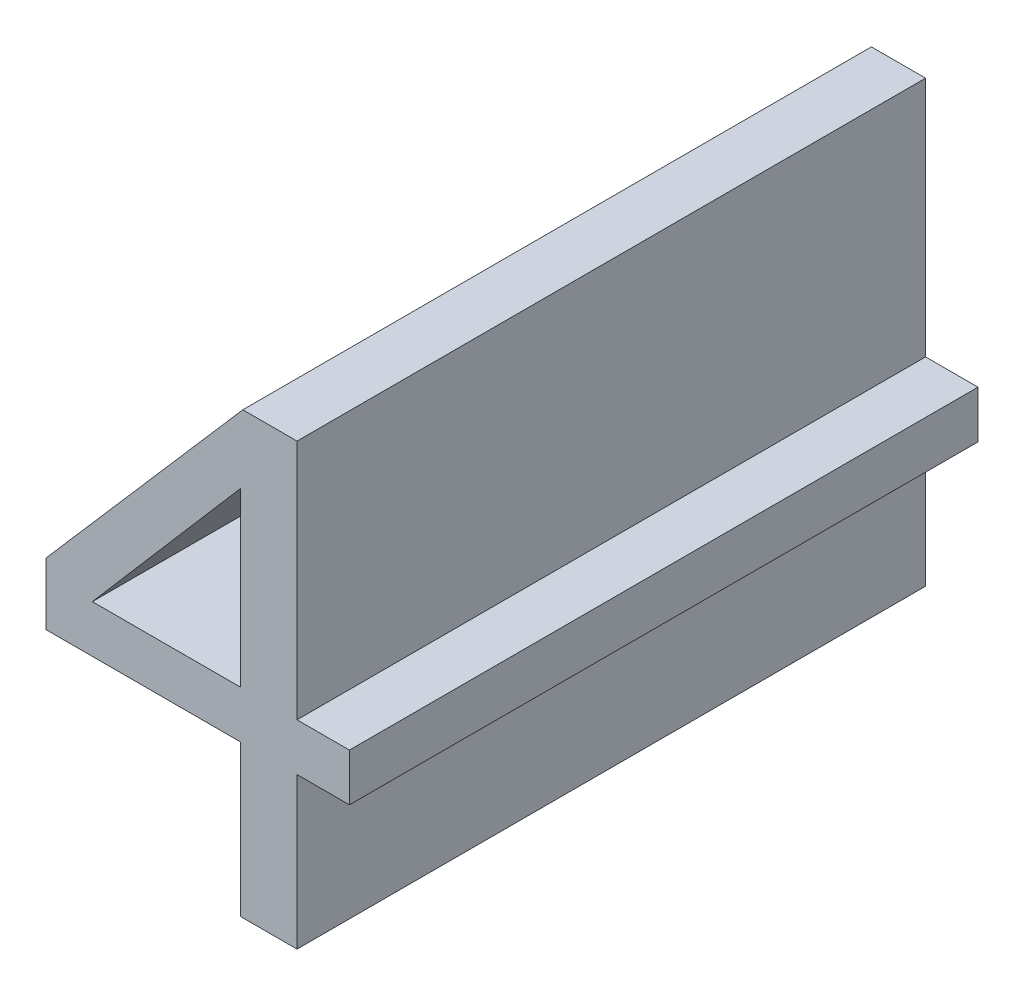
ISO-10303-21;
HEADER;
FILE_DESCRIPTION(('STEP AP214'),'2;1');
FILE_NAME('part.step','',(''),(''),'','','');
FILE_SCHEMA(('AUTOMOTIVE_DESIGN { 1 0 10303 214 1 1 1 1 }'));
ENDSEC;
DATA;
#1=APPLICATION_CONTEXT('core data for automotive mechanical design processes');
#2=APPLICATION_PROTOCOL_DEFINITION('international standard','automotive_design',2000,#1);
#3=PRODUCT_CONTEXT('',#1,'mechanical');
#4=PRODUCT('Part','Part','',(#3));
#5=PRODUCT_RELATED_PRODUCT_CATEGORY('part','',(#4));
#6=PRODUCT_DEFINITION_FORMATION('','',#4);
#7=PRODUCT_DEFINITION_CONTEXT('part definition',#1,'design');
#8=PRODUCT_DEFINITION('design','',#6,#7);
#9=PRODUCT_DEFINITION_SHAPE('','',#8);
#10=(LENGTH_UNIT() NAMED_UNIT(*) SI_UNIT(.MILLI.,.METRE.));
#11=(NAMED_UNIT(*) PLANE_ANGLE_UNIT() SI_UNIT($,.RADIAN.));
#12=(NAMED_UNIT(*) SI_UNIT($,.STERADIAN.) SOLID_ANGLE_UNIT());
#13=UNCERTAINTY_MEASURE_WITH_UNIT(LENGTH_MEASURE(1.E-05),#10,'distance_accuracy_value','');
#14=(GEOMETRIC_REPRESENTATION_CONTEXT(3) GLOBAL_UNCERTAINTY_ASSIGNED_CONTEXT((#13)) GLOBAL_UNIT_ASSIGNED_CONTEXT((#10,
#11,#12)) REPRESENTATION_CONTEXT('',''));
#15=CARTESIAN_POINT('',(0.,0.,0.));
#16=DIRECTION('',(0.,0.,1.));
#17=DIRECTION('',(1.,0.,0.));
#18=AXIS2_PLACEMENT_3D('',#15,#16,#17);
#19=CARTESIAN_POINT('',(0.495750116914341,-0.540318162324596,0.));
#20=DIRECTION('',(0.,-1.,0.));
#21=DIRECTION('',(1.,0.,0.));
#22=AXIS2_PLACEMENT_3D('',#19,#20,#21);
#23=PLANE('',#22);
#24=DIRECTION('',(1.,0.,0.));
#25=VECTOR('',#24,1.);
#26=CARTESIAN_POINT('',(0.495750116914341,-0.540318162324596,0.));
#27=LINE('',#26,#25);
#28=CARTESIAN_POINT('',(0.495750116914341,-0.540318162324596,0.));
#29=VERTEX_POINT('',#28);
#30=CARTESIAN_POINT('',(0.519291446652329,-0.540318162324596,0.));
#31=VERTEX_POINT('',#30);
#32=EDGE_CURVE('E11',#29,#31,#27,.T.);
#33=ORIENTED_EDGE('',*,*,#32,.F.);
#34=DIRECTION('',(0.,0.,1.));
#35=VECTOR('',#34,1.);
#36=CARTESIAN_POINT('',(0.495750116914341,-0.540318162324596,0.));
#37=LINE('',#36,#35);
#38=CARTESIAN_POINT('',(0.495750116914341,-0.540318162324596,0.1));
#39=VERTEX_POINT('',#38);
#40=EDGE_CURVE('E232',#29,#39,#37,.T.);
#41=ORIENTED_EDGE('',*,*,#40,.T.);
#42=DIRECTION('',(-1.,0.,0.));
#43=VECTOR('',#42,1.);
#44=CARTESIAN_POINT('',(0.519291446652329,-0.540318162324596,0.1));
#45=LINE('',#44,#43);
#46=CARTESIAN_POINT('',(0.519291446652329,-0.540318162324596,0.1));
#47=VERTEX_POINT('',#46);
#48=EDGE_CURVE('E224',#47,#39,#45,.T.);
#49=ORIENTED_EDGE('',*,*,#48,.F.);
#50=DIRECTION('',(0.,0.,1.));
#51=VECTOR('',#50,1.);
#52=CARTESIAN_POINT('',(0.519291446652329,-0.540318162324596,0.));
#53=LINE('',#52,#51);
#54=EDGE_CURVE('E218',#31,#47,#53,.T.);
#55=ORIENTED_EDGE('',*,*,#54,.F.);
#56=EDGE_LOOP('',(#33,#41,#49,#55));
#57=FACE_BOUND('',#56,.T.);
#58=ADVANCED_FACE('F17',(#57),#23,.F.);
#59=CARTESIAN_POINT('',(0.519291446652329,-0.512976184171077,0.));
#60=DIRECTION('',(-0.757811989834385,0.652472978799314,0.));
#61=DIRECTION('',(-0.652472978799314,-0.757811989834385,0.));
#62=AXIS2_PLACEMENT_3D('',#59,#60,#61);
#63=PLANE('',#62);
#64=DIRECTION('',(-0.652472978799313,-0.757811989834386,0.));
#65=VECTOR('',#64,1.);
#66=CARTESIAN_POINT('',(0.519291446652329,-0.512976184171078,0.));
#67=LINE('',#66,#65);
#68=CARTESIAN_POINT('',(0.519291446652329,-0.512976184171077,0.));
#69=VERTEX_POINT('',#68);
#70=EDGE_CURVE('E24',#69,#29,#67,.T.);
#71=ORIENTED_EDGE('',*,*,#70,.F.);
#72=DIRECTION('',(0.,0.,1.));
#73=VECTOR('',#72,1.);
#74=CARTESIAN_POINT('',(0.519291446652329,-0.512976184171077,0.));
#75=LINE('',#74,#73);
#76=CARTESIAN_POINT('',(0.519291446652329,-0.512976184171077,0.1));
#77=VERTEX_POINT('',#76);
#78=EDGE_CURVE('E227',#69,#77,#75,.T.);
#79=ORIENTED_EDGE('',*,*,#78,.T.);
#80=DIRECTION('',(0.652472978799316,0.757811989834383,0.));
#81=VECTOR('',#80,1.);
#82=CARTESIAN_POINT('',(0.495750116914341,-0.540318162324596,0.1));
#83=LINE('',#82,#81);
#84=EDGE_CURVE('E215',#39,#77,#83,.T.);
#85=ORIENTED_EDGE('',*,*,#84,.F.);
#86=ORIENTED_EDGE('',*,*,#40,.F.);
#87=EDGE_LOOP('',(#71,#79,#85,#86));
#88=FACE_BOUND('',#87,.T.);
#89=ADVANCED_FACE('F239',(#88),#63,.F.);
#90=CARTESIAN_POINT('',(0.519291446652329,-0.540318162324596,0.));
#91=DIRECTION('',(1.,0.,0.));
#92=DIRECTION('',(0.,1.,0.));
#93=AXIS2_PLACEMENT_3D('',#90,#91,#92);
#94=PLANE('',#93);
#95=DIRECTION('',(0.,1.,0.));
#96=VECTOR('',#95,1.);
#97=CARTESIAN_POINT('',(0.519291446652329,-0.540318162324596,0.));
#98=LINE('',#97,#96);
#99=EDGE_CURVE('E229',#31,#69,#98,.T.);
#100=ORIENTED_EDGE('',*,*,#99,.F.);
#101=ORIENTED_EDGE('',*,*,#54,.T.);
#102=DIRECTION('',(0.,-1.,0.));
#103=VECTOR('',#102,1.);
#104=CARTESIAN_POINT('',(0.519291446652329,-0.512976184171077,0.1));
#105=LINE('',#104,#103);
#106=EDGE_CURVE('E207',#77,#47,#105,.T.);
#107=ORIENTED_EDGE('',*,*,#106,.F.);
#108=ORIENTED_EDGE('',*,*,#78,.F.);
#109=EDGE_LOOP('',(#100,#101,#107,#108));
#110=FACE_BOUND('',#109,.T.);
#111=ADVANCED_FACE('F236',(#110),#94,.F.);
#112=CARTESIAN_POINT('',(0.528310895877245,-0.571914597659679,0.));
#113=DIRECTION('',(1.,0.,0.));
#114=DIRECTION('',(0.,1.,0.));
#115=AXIS2_PLACEMENT_3D('',#112,#113,#114);
#116=PLANE('',#115);
#117=DIRECTION('',(0.,-1.,0.));
#118=VECTOR('',#117,1.);
#119=CARTESIAN_POINT('',(0.528310895877245,-0.547862733059903,0.));
#120=LINE('',#119,#118);
#121=CARTESIAN_POINT('',(0.528310895877245,-0.547862733059903,0.));
#122=VERTEX_POINT('',#121);
#123=CARTESIAN_POINT('',(0.528310895877245,-0.571914597659679,0.));
#124=VERTEX_POINT('',#123);
#125=EDGE_CURVE('E221',#122,#124,#120,.T.);
#126=ORIENTED_EDGE('',*,*,#125,.F.);
#127=DIRECTION('',(0.,0.,1.));
#128=VECTOR('',#127,1.);
#129=CARTESIAN_POINT('',(0.528310895877245,-0.547862733059903,0.));
#130=LINE('',#129,#128);
#131=CARTESIAN_POINT('',(0.528310895877245,-0.547862733059903,0.1));
#132=VERTEX_POINT('',#131);
#133=EDGE_CURVE('E210',#122,#132,#130,.T.);
#134=ORIENTED_EDGE('',*,*,#133,.T.);
#135=DIRECTION('',(0.,1.,0.));
#136=VECTOR('',#135,1.);
#137=CARTESIAN_POINT('',(0.528310895877245,-0.571914597659679,0.1));
#138=LINE('',#137,#136);
#139=CARTESIAN_POINT('',(0.528310895877245,-0.571914597659679,0.1));
#140=VERTEX_POINT('',#139);
#141=EDGE_CURVE('E141',#140,#132,#138,.T.);
#142=ORIENTED_EDGE('',*,*,#141,.F.);
#143=DIRECTION('',(0.,0.,1.));
#144=VECTOR('',#143,1.);
#145=CARTESIAN_POINT('',(0.528310895877245,-0.571914597659679,0.));
#146=LINE('',#145,#144);
#147=EDGE_CURVE('E202',#124,#140,#146,.T.);
#148=ORIENTED_EDGE('',*,*,#147,.F.);
#149=EDGE_LOOP('',(#126,#134,#142,#148));
#150=FACE_BOUND('',#149,.T.);
#151=ADVANCED_FACE('F246',(#150),#116,.T.);
#152=CARTESIAN_POINT('',(0.519291446652329,-0.571914597659679,0.));
#153=DIRECTION('',(0.,-1.,0.));
#154=DIRECTION('',(1.,0.,0.));
#155=AXIS2_PLACEMENT_3D('',#152,#153,#154);
#156=PLANE('',#155);
#157=DIRECTION('',(-1.,0.,0.));
#158=VECTOR('',#157,1.);
#159=CARTESIAN_POINT('',(0.528310895877245,-0.571914597659679,0.));
#160=LINE('',#159,#158);
#161=CARTESIAN_POINT('',(0.519291446652329,-0.571914597659679,0.));
#162=VERTEX_POINT('',#161);
#163=EDGE_CURVE('E212',#124,#162,#160,.T.);
#164=ORIENTED_EDGE('',*,*,#163,.F.);
#165=ORIENTED_EDGE('',*,*,#147,.T.);
#166=DIRECTION('',(1.,0.,0.));
#167=VECTOR('',#166,1.);
#168=CARTESIAN_POINT('',(0.519291446652329,-0.571914597659679,0.1));
#169=LINE('',#168,#167);
#170=CARTESIAN_POINT('',(0.519291446652329,-0.571914597659679,0.1));
#171=VERTEX_POINT('',#170);
#172=EDGE_CURVE('E194',#171,#140,#169,.T.);
#173=ORIENTED_EDGE('',*,*,#172,.F.);
#174=DIRECTION('',(0.,0.,1.));
#175=VECTOR('',#174,1.);
#176=CARTESIAN_POINT('',(0.519291446652329,-0.571914597659679,0.));
#177=LINE('',#176,#175);
#178=EDGE_CURVE('E196',#162,#171,#177,.T.);
#179=ORIENTED_EDGE('',*,*,#178,.F.);
#180=EDGE_LOOP('',(#164,#165,#173,#179));
#181=FACE_BOUND('',#180,.T.);
#182=ADVANCED_FACE('F254',(#181),#156,.T.);
#183=CARTESIAN_POINT('',(0.519291446652329,-0.547862733059903,0.));
#184=DIRECTION('',(-1.,0.,0.));
#185=DIRECTION('',(0.,-1.,0.));
#186=AXIS2_PLACEMENT_3D('',#183,#184,#185);
#187=PLANE('',#186);
#188=DIRECTION('',(0.,1.,0.));
#189=VECTOR('',#188,1.);
#190=CARTESIAN_POINT('',(0.519291446652329,-0.571914597659679,0.));
#191=LINE('',#190,#189);
#192=CARTESIAN_POINT('',(0.519291446652329,-0.547862733059903,0.));
#193=VERTEX_POINT('',#192);
#194=EDGE_CURVE('E204',#162,#193,#191,.T.);
#195=ORIENTED_EDGE('',*,*,#194,.F.);
#196=ORIENTED_EDGE('',*,*,#178,.T.);
#197=DIRECTION('',(0.,-1.,0.));
#198=VECTOR('',#197,1.);
#199=CARTESIAN_POINT('',(0.519291446652329,-0.547862733059903,0.1));
#200=LINE('',#199,#198);
#201=CARTESIAN_POINT('',(0.519291446652329,-0.547862733059903,0.1));
#202=VERTEX_POINT('',#201);
#203=EDGE_CURVE('E186',#202,#171,#200,.T.);
#204=ORIENTED_EDGE('',*,*,#203,.F.);
#205=DIRECTION('',(0.,0.,1.));
#206=VECTOR('',#205,1.);
#207=CARTESIAN_POINT('',(0.519291446652329,-0.547862733059903,0.));
#208=LINE('',#207,#206);
#209=EDGE_CURVE('E189',#193,#202,#208,.T.);
#210=ORIENTED_EDGE('',*,*,#209,.F.);
#211=EDGE_LOOP('',(#195,#196,#204,#210));
#212=FACE_BOUND('',#211,.T.);
#213=ADVANCED_FACE('F260',(#212),#187,.T.);
#214=CARTESIAN_POINT('',(0.488375724466297,-0.547862733059903,0.));
#215=DIRECTION('',(0.,-1.,0.));
#216=DIRECTION('',(1.,0.,0.));
#217=AXIS2_PLACEMENT_3D('',#214,#215,#216);
#218=PLANE('',#217);
#219=DIRECTION('',(-1.,0.,0.));
#220=VECTOR('',#219,1.);
#221=CARTESIAN_POINT('',(0.519291446652329,-0.547862733059903,0.));
#222=LINE('',#221,#220);
#223=CARTESIAN_POINT('',(0.488375724466297,-0.547862733059903,0.));
#224=VERTEX_POINT('',#223);
#225=EDGE_CURVE('E198',#193,#224,#222,.T.);
#226=ORIENTED_EDGE('',*,*,#225,.F.);
#227=ORIENTED_EDGE('',*,*,#209,.T.);
#228=DIRECTION('',(1.,0.,0.));
#229=VECTOR('',#228,1.);
#230=CARTESIAN_POINT('',(0.488375724466297,-0.547862733059903,0.1));
#231=LINE('',#230,#229);
#232=CARTESIAN_POINT('',(0.488375724466297,-0.547862733059903,0.1));
#233=VERTEX_POINT('',#232);
#234=EDGE_CURVE('E178',#233,#202,#231,.T.);
#235=ORIENTED_EDGE('',*,*,#234,.F.);
#236=DIRECTION('',(0.,0.,1.));
#237=VECTOR('',#236,1.);
#238=CARTESIAN_POINT('',(0.488375724466297,-0.547862733059903,0.));
#239=LINE('',#238,#237);
#240=EDGE_CURVE('E181',#224,#233,#239,.T.);
#241=ORIENTED_EDGE('',*,*,#240,.F.);
#242=EDGE_LOOP('',(#226,#227,#235,#241));
#243=FACE_BOUND('',#242,.T.);
#244=ADVANCED_FACE('F264',(#243),#218,.T.);
#245=CARTESIAN_POINT('',(0.488375724466297,-0.537992392398674,0.));
#246=DIRECTION('',(-1.,0.,0.));
#247=DIRECTION('',(0.,-1.,0.));
#248=AXIS2_PLACEMENT_3D('',#245,#246,#247);
#249=PLANE('',#248);
#250=DIRECTION('',(0.,1.,0.));
#251=VECTOR('',#250,1.);
#252=CARTESIAN_POINT('',(0.488375724466297,-0.547862733059903,0.));
#253=LINE('',#252,#251);
#254=CARTESIAN_POINT('',(0.488375724466297,-0.537992392398674,0.));
#255=VERTEX_POINT('',#254);
#256=EDGE_CURVE('E191',#224,#255,#253,.T.);
#257=ORIENTED_EDGE('',*,*,#256,.F.);
#258=ORIENTED_EDGE('',*,*,#240,.T.);
#259=DIRECTION('',(0.,-1.,0.));
#260=VECTOR('',#259,1.);
#261=CARTESIAN_POINT('',(0.488375724466297,-0.537992392398674,0.1));
#262=LINE('',#261,#260);
#263=CARTESIAN_POINT('',(0.488375724466297,-0.537992392398674,0.1));
#264=VERTEX_POINT('',#263);
#265=EDGE_CURVE('E170',#264,#233,#262,.T.);
#266=ORIENTED_EDGE('',*,*,#265,.F.);
#267=DIRECTION('',(0.,0.,1.));
#268=VECTOR('',#267,1.);
#269=CARTESIAN_POINT('',(0.488375724466297,-0.537992392398674,0.));
#270=LINE('',#269,#268);
#271=EDGE_CURVE('E173',#255,#264,#270,.T.);
#272=ORIENTED_EDGE('',*,*,#271,.F.);
#273=EDGE_LOOP('',(#257,#258,#266,#272));
#274=FACE_BOUND('',#273,.T.);
#275=ADVANCED_FACE('F270',(#274),#249,.T.);
#276=CARTESIAN_POINT('',(0.519688529322609,-0.50191459549901,0.));
#277=DIRECTION('',(-0.755218729871842,0.655472859888769,0.));
#278=DIRECTION('',(-0.655472859888769,-0.755218729871842,0.));
#279=AXIS2_PLACEMENT_3D('',#276,#277,#278);
#280=PLANE('',#279);
#281=DIRECTION('',(0.65547285988877,0.755218729871841,0.));
#282=VECTOR('',#281,1.);
#283=CARTESIAN_POINT('',(0.488375724466297,-0.537992392398674,0.));
#284=LINE('',#283,#282);
#285=CARTESIAN_POINT('',(0.519688529322609,-0.50191459549901,0.));
#286=VERTEX_POINT('',#285);
#287=EDGE_CURVE('E183',#255,#286,#284,.T.);
#288=ORIENTED_EDGE('',*,*,#287,.F.);
#289=ORIENTED_EDGE('',*,*,#271,.T.);
#290=DIRECTION('',(-0.655472859888772,-0.755218729871839,0.));
#291=VECTOR('',#290,1.);
#292=CARTESIAN_POINT('',(0.519688529322609,-0.50191459549901,0.1));
#293=LINE('',#292,#291);
#294=CARTESIAN_POINT('',(0.519688529322609,-0.50191459549901,0.1));
#295=VERTEX_POINT('',#294);
#296=EDGE_CURVE('E162',#295,#264,#293,.T.);
#297=ORIENTED_EDGE('',*,*,#296,.F.);
#298=DIRECTION('',(0.,0.,1.));
#299=VECTOR('',#298,1.);
#300=CARTESIAN_POINT('',(0.519688529322609,-0.50191459549901,0.));
#301=LINE('',#300,#299);
#302=EDGE_CURVE('E165',#286,#295,#301,.T.);
#303=ORIENTED_EDGE('',*,*,#302,.F.);
#304=EDGE_LOOP('',(#288,#289,#297,#303));
#305=FACE_BOUND('',#304,.T.);
#306=ADVANCED_FACE('F274',(#305),#280,.T.);
#307=CARTESIAN_POINT('',(0.528310895877245,-0.50191459549901,0.));
#308=DIRECTION('',(0.,1.,0.));
#309=DIRECTION('',(-1.,0.,0.));
#310=AXIS2_PLACEMENT_3D('',#307,#308,#309);
#311=PLANE('',#310);
#312=DIRECTION('',(1.,0.,0.));
#313=VECTOR('',#312,1.);
#314=CARTESIAN_POINT('',(0.519688529322609,-0.50191459549901,0.));
#315=LINE('',#314,#313);
#316=CARTESIAN_POINT('',(0.528310895877245,-0.50191459549901,0.));
#317=VERTEX_POINT('',#316);
#318=EDGE_CURVE('E175',#286,#317,#315,.T.);
#319=ORIENTED_EDGE('',*,*,#318,.F.);
#320=ORIENTED_EDGE('',*,*,#302,.T.);
#321=DIRECTION('',(-1.,0.,0.));
#322=VECTOR('',#321,1.);
#323=CARTESIAN_POINT('',(0.528310895877245,-0.50191459549901,0.1));
#324=LINE('',#323,#322);
#325=CARTESIAN_POINT('',(0.528310895877245,-0.50191459549901,0.1));
#326=VERTEX_POINT('',#325);
#327=EDGE_CURVE('E154',#326,#295,#324,.T.);
#328=ORIENTED_EDGE('',*,*,#327,.F.);
#329=DIRECTION('',(0.,0.,1.));
#330=VECTOR('',#329,1.);
#331=CARTESIAN_POINT('',(0.528310895877245,-0.50191459549901,0.));
#332=LINE('',#331,#330);
#333=EDGE_CURVE('E157',#317,#326,#332,.T.);
#334=ORIENTED_EDGE('',*,*,#333,.F.);
#335=EDGE_LOOP('',(#319,#320,#328,#334));
#336=FACE_BOUND('',#335,.T.);
#337=ADVANCED_FACE('F278',(#336),#311,.T.);
#338=CARTESIAN_POINT('',(0.528310895877245,-0.540318162324596,0.));
#339=DIRECTION('',(1.,0.,0.));
#340=DIRECTION('',(0.,1.,0.));
#341=AXIS2_PLACEMENT_3D('',#338,#339,#340);
#342=PLANE('',#341);
#343=DIRECTION('',(0.,-1.,0.));
#344=VECTOR('',#343,1.);
#345=CARTESIAN_POINT('',(0.528310895877245,-0.50191459549901,0.));
#346=LINE('',#345,#344);
#347=CARTESIAN_POINT('',(0.528310895877245,-0.540318162324596,0.));
#348=VERTEX_POINT('',#347);
#349=EDGE_CURVE('E167',#317,#348,#346,.T.);
#350=ORIENTED_EDGE('',*,*,#349,.F.);
#351=ORIENTED_EDGE('',*,*,#333,.T.);
#352=DIRECTION('',(0.,1.,0.));
#353=VECTOR('',#352,1.);
#354=CARTESIAN_POINT('',(0.528310895877245,-0.540318162324596,0.1));
#355=LINE('',#354,#353);
#356=CARTESIAN_POINT('',(0.528310895877245,-0.540318162324596,0.1));
#357=VERTEX_POINT('',#356);
#358=EDGE_CURVE('E147',#357,#326,#355,.T.);
#359=ORIENTED_EDGE('',*,*,#358,.F.);
#360=DIRECTION('',(0.,0.,1.));
#361=VECTOR('',#360,1.);
#362=CARTESIAN_POINT('',(0.528310895877245,-0.540318162324596,0.));
#363=LINE('',#362,#361);
#364=EDGE_CURVE('E150',#348,#357,#363,.T.);
#365=ORIENTED_EDGE('',*,*,#364,.F.);
#366=EDGE_LOOP('',(#350,#351,#359,#365));
#367=FACE_BOUND('',#366,.T.);
#368=ADVANCED_FACE('F282',(#367),#342,.T.);
#369=CARTESIAN_POINT('',(0.536649631953111,-0.540318162324596,0.));
#370=DIRECTION('',(0.,1.,0.));
#371=DIRECTION('',(-1.,0.,0.));
#372=AXIS2_PLACEMENT_3D('',#369,#370,#371);
#373=PLANE('',#372);
#374=DIRECTION('',(1.,0.,0.));
#375=VECTOR('',#374,1.);
#376=CARTESIAN_POINT('',(0.528310895877245,-0.540318162324596,0.));
#377=LINE('',#376,#375);
#378=CARTESIAN_POINT('',(0.536649631953111,-0.540318162324596,0.));
#379=VERTEX_POINT('',#378);
#380=EDGE_CURVE('E159',#348,#379,#377,.T.);
#381=ORIENTED_EDGE('',*,*,#380,.F.);
#382=ORIENTED_EDGE('',*,*,#364,.T.);
#383=DIRECTION('',(-1.,0.,0.));
#384=VECTOR('',#383,1.);
#385=CARTESIAN_POINT('',(0.536649631953111,-0.540318162324596,0.1));
#386=LINE('',#385,#384);
#387=CARTESIAN_POINT('',(0.536649631953111,-0.540318162324596,0.1));
#388=VERTEX_POINT('',#387);
#389=EDGE_CURVE('E126',#388,#357,#386,.T.);
#390=ORIENTED_EDGE('',*,*,#389,.F.);
#391=DIRECTION('',(0.,0.,1.));
#392=VECTOR('',#391,1.);
#393=CARTESIAN_POINT('',(0.536649631953111,-0.540318162324596,0.));
#394=LINE('',#393,#392);
#395=EDGE_CURVE('E132',#379,#388,#394,.T.);
#396=ORIENTED_EDGE('',*,*,#395,.F.);
#397=EDGE_LOOP('',(#381,#382,#390,#396));
#398=FACE_BOUND('',#397,.T.);
#399=ADVANCED_FACE('F286',(#398),#373,.T.);
#400=CARTESIAN_POINT('',(0.536649631953111,-0.547862733059903,0.));
#401=DIRECTION('',(1.,0.,0.));
#402=DIRECTION('',(0.,1.,0.));
#403=AXIS2_PLACEMENT_3D('',#400,#401,#402);
#404=PLANE('',#403);
#405=DIRECTION('',(0.,-1.,0.));
#406=VECTOR('',#405,1.);
#407=CARTESIAN_POINT('',(0.536649631953111,-0.540318162324596,0.));
#408=LINE('',#407,#406);
#409=CARTESIAN_POINT('',(0.536649631953111,-0.547862733059903,0.));
#410=VERTEX_POINT('',#409);
#411=EDGE_CURVE('E152',#379,#410,#408,.T.);
#412=ORIENTED_EDGE('',*,*,#411,.F.);
#413=ORIENTED_EDGE('',*,*,#395,.T.);
#414=DIRECTION('',(0.,1.,0.));
#415=VECTOR('',#414,1.);
#416=CARTESIAN_POINT('',(0.536649631953111,-0.547862733059903,0.1));
#417=LINE('',#416,#415);
#418=CARTESIAN_POINT('',(0.536649631953111,-0.547862733059903,0.1));
#419=VERTEX_POINT('',#418);
#420=EDGE_CURVE('E127',#419,#388,#417,.T.);
#421=ORIENTED_EDGE('',*,*,#420,.F.);
#422=DIRECTION('',(0.,0.,1.));
#423=VECTOR('',#422,1.);
#424=CARTESIAN_POINT('',(0.536649631953111,-0.547862733059903,0.));
#425=LINE('',#424,#423);
#426=EDGE_CURVE('E115',#410,#419,#425,.T.);
#427=ORIENTED_EDGE('',*,*,#426,.F.);
#428=EDGE_LOOP('',(#412,#413,#421,#427));
#429=FACE_BOUND('',#428,.T.);
#430=ADVANCED_FACE('F130',(#429),#404,.T.);
#431=CARTESIAN_POINT('',(0.528310895877245,-0.547862733059903,0.));
#432=DIRECTION('',(0.,-1.,0.));
#433=DIRECTION('',(1.,0.,0.));
#434=AXIS2_PLACEMENT_3D('',#431,#432,#433);
#435=PLANE('',#434);
#436=DIRECTION('',(-1.,0.,0.));
#437=VECTOR('',#436,1.);
#438=CARTESIAN_POINT('',(0.536649631953111,-0.547862733059903,0.));
#439=LINE('',#438,#437);
#440=EDGE_CURVE('E123',#410,#122,#439,.T.);
#441=ORIENTED_EDGE('',*,*,#440,.F.);
#442=ORIENTED_EDGE('',*,*,#426,.T.);
#443=DIRECTION('',(1.,0.,0.));
#444=VECTOR('',#443,1.);
#445=CARTESIAN_POINT('',(0.528310895877245,-0.547862733059903,0.1));
#446=LINE('',#445,#444);
#447=EDGE_CURVE('E120',#132,#419,#446,.T.);
#448=ORIENTED_EDGE('',*,*,#447,.F.);
#449=ORIENTED_EDGE('',*,*,#133,.F.);
#450=EDGE_LOOP('',(#441,#442,#448,#449));
#451=FACE_BOUND('',#450,.T.);
#452=ADVANCED_FACE('F117',(#451),#435,.T.);
#453=CARTESIAN_POINT('',(0.51691049615683,-0.53817633661392,0.));
#454=DIRECTION('',(0.,0.,1.));
#455=DIRECTION('',(1.,0.,0.));
#456=AXIS2_PLACEMENT_3D('',#453,#454,#455);
#457=PLANE('',#456);
#458=ORIENTED_EDGE('',*,*,#440,.T.);
#459=ORIENTED_EDGE('',*,*,#125,.T.);
#460=ORIENTED_EDGE('',*,*,#163,.T.);
#461=ORIENTED_EDGE('',*,*,#194,.T.);
#462=ORIENTED_EDGE('',*,*,#225,.T.);
#463=ORIENTED_EDGE('',*,*,#256,.T.);
#464=ORIENTED_EDGE('',*,*,#287,.T.);
#465=ORIENTED_EDGE('',*,*,#318,.T.);
#466=ORIENTED_EDGE('',*,*,#349,.T.);
#467=ORIENTED_EDGE('',*,*,#380,.T.);
#468=ORIENTED_EDGE('',*,*,#411,.T.);
#469=EDGE_LOOP('',(#458,#459,#460,#461,#462,#463,#464,#465,#466,#467,#468));
#470=FACE_BOUND('',#469,.T.);
#471=ORIENTED_EDGE('',*,*,#32,.T.);
#472=ORIENTED_EDGE('',*,*,#99,.T.);
#473=ORIENTED_EDGE('',*,*,#70,.T.);
#474=EDGE_LOOP('',(#471,#472,#473));
#475=FACE_BOUND('',#474,.T.);
#476=ADVANCED_FACE('F234',(#470,#475),#457,.F.);
#477=CARTESIAN_POINT('',(0.51691049615683,-0.53817633661392,0.1));
#478=DIRECTION('',(0.,0.,1.));
#479=DIRECTION('',(1.,0.,0.));
#480=AXIS2_PLACEMENT_3D('',#477,#478,#479);
#481=PLANE('',#480);
#482=ORIENTED_EDGE('',*,*,#447,.T.);
#483=ORIENTED_EDGE('',*,*,#420,.T.);
#484=ORIENTED_EDGE('',*,*,#389,.T.);
#485=ORIENTED_EDGE('',*,*,#358,.T.);
#486=ORIENTED_EDGE('',*,*,#327,.T.);
#487=ORIENTED_EDGE('',*,*,#296,.T.);
#488=ORIENTED_EDGE('',*,*,#265,.T.);
#489=ORIENTED_EDGE('',*,*,#234,.T.);
#490=ORIENTED_EDGE('',*,*,#203,.T.);
#491=ORIENTED_EDGE('',*,*,#172,.T.);
#492=ORIENTED_EDGE('',*,*,#141,.T.);
#493=EDGE_LOOP('',(#482,#483,#484,#485,#486,#487,#488,#489,#490,#491,#492));
#494=FACE_BOUND('',#493,.T.);
#495=ORIENTED_EDGE('',*,*,#48,.T.);
#496=ORIENTED_EDGE('',*,*,#84,.T.);
#497=ORIENTED_EDGE('',*,*,#106,.T.);
#498=EDGE_LOOP('',(#495,#496,#497));
#499=FACE_BOUND('',#498,.T.);
#500=ADVANCED_FACE('F137',(#494,#499),#481,.T.);
#501=CLOSED_SHELL('',(#58,#89,#111,#151,#182,#213,#244,#275,#306,#337,#368,#399,#430,#452,#476,#500));
#502=MANIFOLD_SOLID_BREP('B1',#501);
#503=ADVANCED_BREP_SHAPE_REPRESENTATION('',(#18,#502),#14);
#504=SHAPE_DEFINITION_REPRESENTATION(#9,#503);
ENDSEC;
END-ISO-10303-21;
